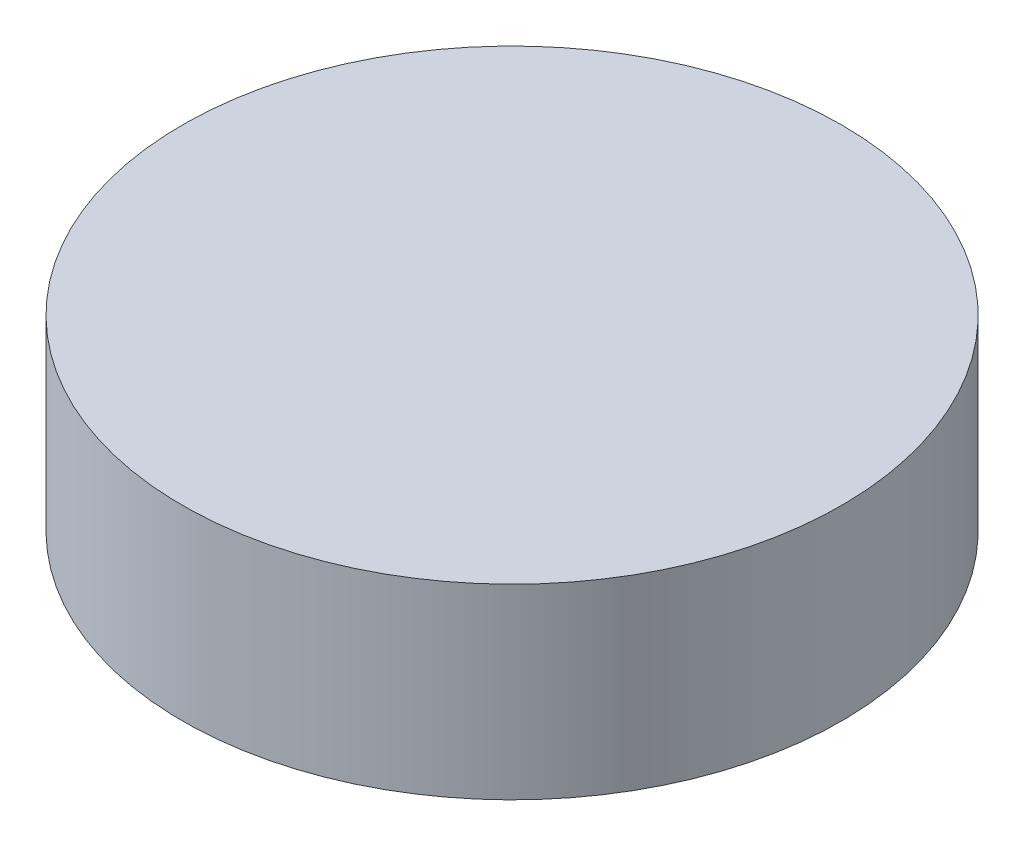
ISO-10303-21;
HEADER;
FILE_DESCRIPTION(('STEP AP214'),'2;1');
FILE_NAME('part.step','',(''),(''),'','','');
FILE_SCHEMA(('AUTOMOTIVE_DESIGN { 1 0 10303 214 1 1 1 1 }'));
ENDSEC;
DATA;
#1=APPLICATION_CONTEXT('core data for automotive mechanical design processes');
#2=APPLICATION_PROTOCOL_DEFINITION('international standard','automotive_design',2000,#1);
#3=PRODUCT_CONTEXT('',#1,'mechanical');
#4=PRODUCT('Part','Part','',(#3));
#5=PRODUCT_RELATED_PRODUCT_CATEGORY('part','',(#4));
#6=PRODUCT_DEFINITION_FORMATION('','',#4);
#7=PRODUCT_DEFINITION_CONTEXT('part definition',#1,'design');
#8=PRODUCT_DEFINITION('design','',#6,#7);
#9=PRODUCT_DEFINITION_SHAPE('','',#8);
#10=(LENGTH_UNIT() NAMED_UNIT(*) SI_UNIT(.MILLI.,.METRE.));
#11=(NAMED_UNIT(*) PLANE_ANGLE_UNIT() SI_UNIT($,.RADIAN.));
#12=(NAMED_UNIT(*) SI_UNIT($,.STERADIAN.) SOLID_ANGLE_UNIT());
#13=UNCERTAINTY_MEASURE_WITH_UNIT(LENGTH_MEASURE(1.E-05),#10,'distance_accuracy_value','');
#14=(GEOMETRIC_REPRESENTATION_CONTEXT(3) GLOBAL_UNCERTAINTY_ASSIGNED_CONTEXT((#13)) GLOBAL_UNIT_ASSIGNED_CONTEXT((#10,
#11,#12)) REPRESENTATION_CONTEXT('',''));
#15=CARTESIAN_POINT('',(0.,0.,0.));
#16=DIRECTION('',(0.,0.,1.));
#17=DIRECTION('',(1.,0.,0.));
#18=AXIS2_PLACEMENT_3D('',#15,#16,#17);
#19=CARTESIAN_POINT('',(0.,0.,0.));
#20=DIRECTION('',(0.,-1.,0.));
#21=DIRECTION('',(0.,0.,-1.));
#22=AXIS2_PLACEMENT_3D('',#19,#20,#21);
#23=PLANE('',#22);
#24=CARTESIAN_POINT('',(0.,0.,0.));
#25=DIRECTION('',(0.,-1.,0.));
#26=DIRECTION('',(0.,0.,-1.));
#27=AXIS2_PLACEMENT_3D('',#24,#25,#26);
#28=CIRCLE('',#27,15.);
#29=CARTESIAN_POINT('',(0.,0.,-15.));
#30=VERTEX_POINT('',#29);
#31=EDGE_CURVE('E10',#30,#30,#28,.T.);
#32=ORIENTED_EDGE('',*,*,#31,.T.);
#33=EDGE_LOOP('',(#32));
#34=FACE_BOUND('',#33,.T.);
#35=ADVANCED_FACE('F15',(#34),#23,.T.);
#36=CARTESIAN_POINT('',(0.,-60.,0.));
#37=DIRECTION('',(0.,-1.,0.));
#38=DIRECTION('',(0.,0.,-1.));
#39=AXIS2_PLACEMENT_3D('',#36,#37,#38);
#40=CYLINDRICAL_SURFACE('',#39,15.);
#41=CARTESIAN_POINT('',(0.,8.5,0.));
#42=DIRECTION('',(0.,-1.,0.));
#43=DIRECTION('',(0.,0.,-1.));
#44=AXIS2_PLACEMENT_3D('',#41,#42,#43);
#45=CIRCLE('',#44,15.);
#46=CARTESIAN_POINT('',(0.,8.5,-15.));
#47=VERTEX_POINT('',#46);
#48=EDGE_CURVE('E18',#47,#47,#45,.F.);
#49=ORIENTED_EDGE('',*,*,#48,.F.);
#50=EDGE_LOOP('',(#49));
#51=FACE_BOUND('',#50,.T.);
#52=ORIENTED_EDGE('',*,*,#31,.F.);
#53=EDGE_LOOP('',(#52));
#54=FACE_BOUND('',#53,.T.);
#55=ADVANCED_FACE('F29',(#51,#54),#40,.T.);
#56=CARTESIAN_POINT('',(0.,8.5,0.));
#57=DIRECTION('',(0.,-1.,0.));
#58=DIRECTION('',(0.,0.,-1.));
#59=AXIS2_PLACEMENT_3D('',#56,#57,#58);
#60=PLANE('',#59);
#61=ORIENTED_EDGE('',*,*,#48,.T.);
#62=EDGE_LOOP('',(#61));
#63=FACE_BOUND('',#62,.T.);
#64=ADVANCED_FACE('F27',(#63),#60,.F.);
#65=CLOSED_SHELL('',(#35,#55,#64));
#66=MANIFOLD_SOLID_BREP('B1',#65);
#67=ADVANCED_BREP_SHAPE_REPRESENTATION('',(#18,#66),#14);
#68=SHAPE_DEFINITION_REPRESENTATION(#9,#67);
ENDSEC;
END-ISO-10303-21;
